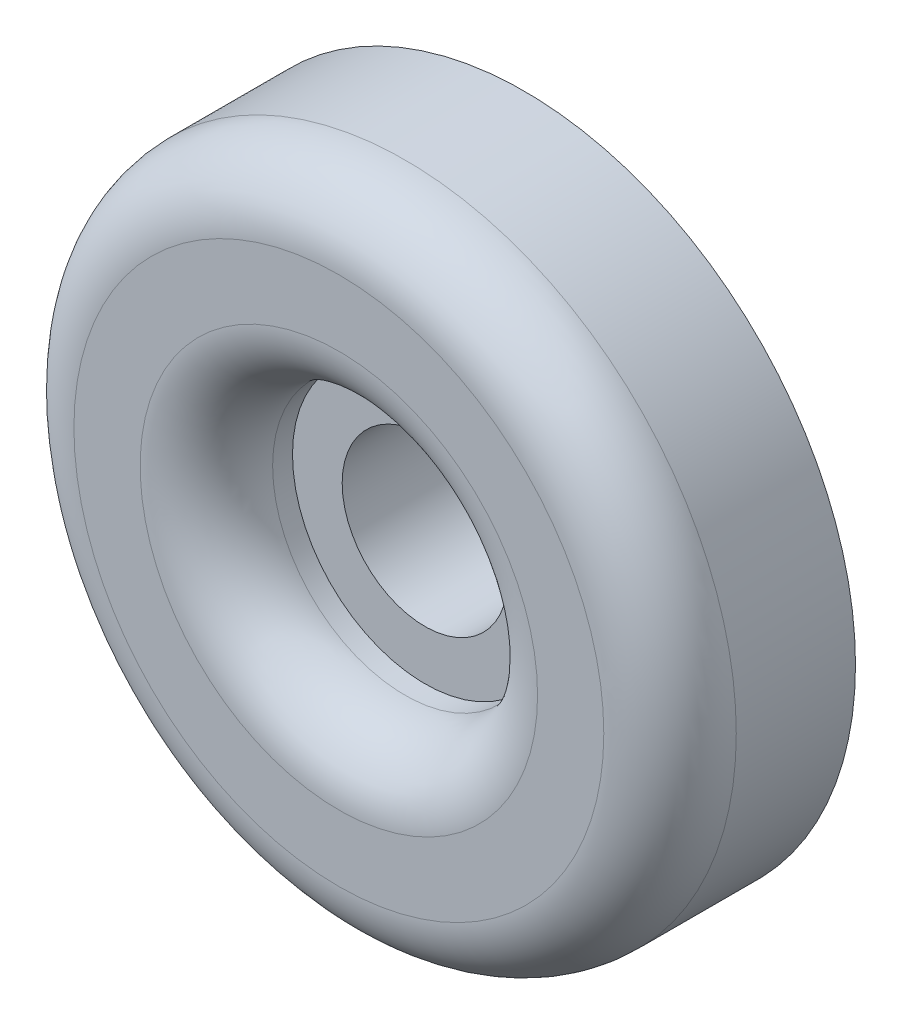
ISO-10303-21;
HEADER;
FILE_DESCRIPTION(('STEP AP214'),'2;1');
FILE_NAME('part.step','',(''),(''),'','','');
FILE_SCHEMA(('AUTOMOTIVE_DESIGN { 1 0 10303 214 1 1 1 1 }'));
ENDSEC;
DATA;
#1=APPLICATION_CONTEXT('core data for automotive mechanical design processes');
#2=APPLICATION_PROTOCOL_DEFINITION('international standard','automotive_design',2000,#1);
#3=PRODUCT_CONTEXT('',#1,'mechanical');
#4=PRODUCT('Part','Part','',(#3));
#5=PRODUCT_RELATED_PRODUCT_CATEGORY('part','',(#4));
#6=PRODUCT_DEFINITION_FORMATION('','',#4);
#7=PRODUCT_DEFINITION_CONTEXT('part definition',#1,'design');
#8=PRODUCT_DEFINITION('design','',#6,#7);
#9=PRODUCT_DEFINITION_SHAPE('','',#8);
#10=(LENGTH_UNIT() NAMED_UNIT(*) SI_UNIT(.MILLI.,.METRE.));
#11=(NAMED_UNIT(*) PLANE_ANGLE_UNIT() SI_UNIT($,.RADIAN.));
#12=(NAMED_UNIT(*) SI_UNIT($,.STERADIAN.) SOLID_ANGLE_UNIT());
#13=UNCERTAINTY_MEASURE_WITH_UNIT(LENGTH_MEASURE(1.E-05),#10,'distance_accuracy_value','');
#14=(GEOMETRIC_REPRESENTATION_CONTEXT(3) GLOBAL_UNCERTAINTY_ASSIGNED_CONTEXT((#13)) GLOBAL_UNIT_ASSIGNED_CONTEXT((#10,
#11,#12)) REPRESENTATION_CONTEXT('',''));
#15=CARTESIAN_POINT('',(0.,0.,0.));
#16=DIRECTION('',(0.,0.,1.));
#17=DIRECTION('',(1.,0.,0.));
#18=AXIS2_PLACEMENT_3D('',#15,#16,#17);
#19=CARTESIAN_POINT('',(0.,0.,3.81));
#20=DIRECTION('',(0.,0.,1.));
#21=DIRECTION('',(1.,0.,0.));
#22=AXIS2_PLACEMENT_3D('',#19,#20,#21);
#23=PLANE('',#22);
#24=CARTESIAN_POINT('',(0.,0.,3.81));
#25=DIRECTION('',(0.,0.,1.));
#26=DIRECTION('',(1.,0.,0.));
#27=AXIS2_PLACEMENT_3D('',#24,#25,#26);
#28=CIRCLE('',#27,3.175);
#29=CARTESIAN_POINT('',(-3.175,0.,3.81));
#30=VERTEX_POINT('',#29);
#31=EDGE_CURVE('E60',#30,#30,#28,.T.);
#32=ORIENTED_EDGE('',*,*,#31,.F.);
#33=EDGE_LOOP('',(#32));
#34=FACE_BOUND('',#33,.T.);
#35=CARTESIAN_POINT('',(0.,0.,3.81));
#36=DIRECTION('',(0.,0.,1.));
#37=DIRECTION('',(1.,0.,0.));
#38=AXIS2_PLACEMENT_3D('',#35,#36,#37);
#39=CIRCLE('',#38,5.08);
#40=CARTESIAN_POINT('',(-5.08,0.,3.81));
#41=VERTEX_POINT('',#40);
#42=EDGE_CURVE('E64',#41,#41,#39,.T.);
#43=ORIENTED_EDGE('',*,*,#42,.T.);
#44=EDGE_LOOP('',(#43));
#45=FACE_BOUND('',#44,.T.);
#46=ADVANCED_FACE('F37',(#34,#45),#23,.T.);
#47=CARTESIAN_POINT('',(0.,0.,0.));
#48=DIRECTION('',(0.,0.,1.));
#49=DIRECTION('',(1.,0.,0.));
#50=AXIS2_PLACEMENT_3D('',#47,#48,#49);
#51=PLANE('',#50);
#52=CARTESIAN_POINT('',(0.,0.,0.));
#53=DIRECTION('',(0.,0.,1.));
#54=DIRECTION('',(1.,0.,0.));
#55=AXIS2_PLACEMENT_3D('',#52,#53,#54);
#56=CIRCLE('',#55,12.7);
#57=CARTESIAN_POINT('',(-12.7,0.,0.));
#58=VERTEX_POINT('',#57);
#59=EDGE_CURVE('E57',#58,#58,#56,.T.);
#60=ORIENTED_EDGE('',*,*,#59,.F.);
#61=EDGE_LOOP('',(#60));
#62=FACE_BOUND('',#61,.T.);
#63=CARTESIAN_POINT('',(0.,0.,0.));
#64=DIRECTION('',(0.,0.,1.));
#65=DIRECTION('',(1.,0.,0.));
#66=AXIS2_PLACEMENT_3D('',#63,#64,#65);
#67=CIRCLE('',#66,3.175);
#68=CARTESIAN_POINT('',(-3.175,0.,0.));
#69=VERTEX_POINT('',#68);
#70=EDGE_CURVE('E61',#69,#69,#67,.T.);
#71=ORIENTED_EDGE('',*,*,#70,.T.);
#72=EDGE_LOOP('',(#71));
#73=FACE_BOUND('',#72,.T.);
#74=ADVANCED_FACE('F85',(#62,#73),#51,.F.);
#75=CARTESIAN_POINT('',(0.,0.,3.81));
#76=DIRECTION('',(0.,0.,-1.));
#77=DIRECTION('',(-1.,0.,0.));
#78=AXIS2_PLACEMENT_3D('',#75,#76,#77);
#79=CYLINDRICAL_SURFACE('',#78,12.7);
#80=CARTESIAN_POINT('',(0.,0.,4.572));
#81=DIRECTION('',(0.,0.,1.));
#82=DIRECTION('',(1.,0.,0.));
#83=AXIS2_PLACEMENT_3D('',#80,#81,#82);
#84=CIRCLE('',#83,12.7);
#85=CARTESIAN_POINT('',(-12.7,0.,4.572));
#86=VERTEX_POINT('',#85);
#87=EDGE_CURVE('E10',#86,#86,#84,.F.);
#88=CARTESIAN_POINT('',(-12.7,0.,4.572));
#89=CARTESIAN_POINT('',(-12.7,0.,4.524375));
#90=CARTESIAN_POINT('',(-12.7,0.,4.47675));
#91=CARTESIAN_POINT('',(-12.7,0.,4.3815));
#92=CARTESIAN_POINT('',(-12.7,0.,4.333875));
#93=CARTESIAN_POINT('',(-12.7,0.,4.238625));
#94=CARTESIAN_POINT('',(-12.7,0.,4.191));
#95=CARTESIAN_POINT('',(-12.7,0.,4.09575));
#96=CARTESIAN_POINT('',(-12.7,0.,4.048125));
#97=CARTESIAN_POINT('',(-12.7,0.,3.952875));
#98=CARTESIAN_POINT('',(-12.7,0.,3.90525));
#99=CARTESIAN_POINT('',(-12.7,0.,3.81));
#100=CARTESIAN_POINT('',(-12.7,0.,3.762375));
#101=CARTESIAN_POINT('',(-12.7,0.,3.667125));
#102=CARTESIAN_POINT('',(-12.7,0.,3.6195));
#103=CARTESIAN_POINT('',(-12.7,0.,3.52425));
#104=CARTESIAN_POINT('',(-12.7,0.,3.476625));
#105=CARTESIAN_POINT('',(-12.7,0.,3.381375));
#106=CARTESIAN_POINT('',(-12.7,0.,3.33375));
#107=CARTESIAN_POINT('',(-12.7,0.,3.2385));
#108=CARTESIAN_POINT('',(-12.7,0.,3.190875));
#109=CARTESIAN_POINT('',(-12.7,0.,3.095625));
#110=CARTESIAN_POINT('',(-12.7,0.,3.048));
#111=CARTESIAN_POINT('',(-12.7,0.,2.95275));
#112=CARTESIAN_POINT('',(-12.7,0.,2.905125));
#113=CARTESIAN_POINT('',(-12.7,0.,2.809875));
#114=CARTESIAN_POINT('',(-12.7,0.,2.76225));
#115=CARTESIAN_POINT('',(-12.7,0.,2.667));
#116=CARTESIAN_POINT('',(-12.7,0.,2.619375));
#117=CARTESIAN_POINT('',(-12.7,0.,2.524125));
#118=CARTESIAN_POINT('',(-12.7,0.,2.4765));
#119=CARTESIAN_POINT('',(-12.7,0.,2.38125));
#120=CARTESIAN_POINT('',(-12.7,0.,2.333625));
#121=CARTESIAN_POINT('',(-12.7,0.,2.238375));
#122=CARTESIAN_POINT('',(-12.7,0.,2.19075));
#123=CARTESIAN_POINT('',(-12.7,0.,2.0955));
#124=CARTESIAN_POINT('',(-12.7,0.,2.047875));
#125=CARTESIAN_POINT('',(-12.7,0.,1.952625));
#126=CARTESIAN_POINT('',(-12.7,0.,1.905));
#127=CARTESIAN_POINT('',(-12.7,0.,1.80975));
#128=CARTESIAN_POINT('',(-12.7,0.,1.762125));
#129=CARTESIAN_POINT('',(-12.7,0.,1.666875));
#130=CARTESIAN_POINT('',(-12.7,0.,1.61925));
#131=CARTESIAN_POINT('',(-12.7,0.,1.524));
#132=CARTESIAN_POINT('',(-12.7,0.,1.476375));
#133=CARTESIAN_POINT('',(-12.7,0.,1.381125));
#134=CARTESIAN_POINT('',(-12.7,0.,1.3335));
#135=CARTESIAN_POINT('',(-12.7,0.,1.23825));
#136=CARTESIAN_POINT('',(-12.7,0.,1.190625));
#137=CARTESIAN_POINT('',(-12.7,0.,1.095375));
#138=CARTESIAN_POINT('',(-12.7,0.,1.04775));
#139=CARTESIAN_POINT('',(-12.7,0.,0.9525));
#140=CARTESIAN_POINT('',(-12.7,0.,0.904875));
#141=CARTESIAN_POINT('',(-12.7,0.,0.809625));
#142=CARTESIAN_POINT('',(-12.7,0.,0.762));
#143=CARTESIAN_POINT('',(-12.7,0.,0.66675));
#144=CARTESIAN_POINT('',(-12.7,0.,0.619125));
#145=CARTESIAN_POINT('',(-12.7,0.,0.523875));
#146=CARTESIAN_POINT('',(-12.7,0.,0.47625));
#147=CARTESIAN_POINT('',(-12.7,0.,0.381));
#148=CARTESIAN_POINT('',(-12.7,0.,0.333375));
#149=CARTESIAN_POINT('',(-12.7,0.,0.238125));
#150=CARTESIAN_POINT('',(-12.7,0.,0.1905));
#151=CARTESIAN_POINT('',(-12.7,0.,0.0952499999999998));
#152=CARTESIAN_POINT('',(-12.7,0.,0.0476249999999999));
#153=CARTESIAN_POINT('',(-12.7,0.,0.));
#154=B_SPLINE_CURVE_WITH_KNOTS('',3,(#88,#89,#90,#91,#92,#93,#94,#95,#96,#97,#98,#99,#100,#101,
#102,#103,#104,#105,#106,#107,#108,#109,#110,#111,#112,#113,#114,#115,#116,#117,#118,#119,#120,
#121,#122,#123,#124,#125,#126,#127,#128,#129,#130,#131,#132,#133,#134,#135,#136,#137,#138,#139,
#140,#141,#142,#143,#144,#145,#146,#147,#148,#149,#150,#151,#152,#153),.UNSPECIFIED.,.F.,.F.,(4,
2,2,2,2,2,2,2,2,2,2,2,2,2,2,2,2,2,2,2,2,2,2,2,2,2,2,2,2,2,2,2,4),(0.,0.142875,0.28575,
0.428624999999999,0.5715,0.714375,0.85725,1.000125,1.143,1.285875,1.42875,1.571625,1.7145,
1.857375,2.00025,2.143125,2.286,2.428875,2.57175,2.714625,2.8575,3.000375,3.14325,3.286125,
3.429,3.571875,3.71475,3.857625,4.0005,4.143375,4.28625,4.429125,4.572),.UNSPECIFIED.);
#155=EDGE_CURVE('BSEAM93',#86,#58,#154,.T.);
#156=ORIENTED_EDGE('',*,*,#87,.T.);
#157=ORIENTED_EDGE('',*,*,#59,.T.);
#158=ORIENTED_EDGE('',*,*,#155,.T.);
#159=ORIENTED_EDGE('',*,*,#155,.F.);
#160=EDGE_LOOP('',(#156,#158,#157,#159));
#161=FACE_BOUND('',#160,.T.);
#162=ADVANCED_FACE('F93',(#161),#79,.T.);
#163=CARTESIAN_POINT('',(0.,0.,3.81));
#164=DIRECTION('',(0.,0.,-1.));
#165=DIRECTION('',(-1.,0.,0.));
#166=AXIS2_PLACEMENT_3D('',#163,#164,#165);
#167=CYLINDRICAL_SURFACE('',#166,3.175);
#168=CARTESIAN_POINT('',(-3.175,0.,3.81));
#169=CARTESIAN_POINT('',(-3.175,0.,3.7703125));
#170=CARTESIAN_POINT('',(-3.175,0.,3.730625));
#171=CARTESIAN_POINT('',(-3.175,0.,3.65125));
#172=CARTESIAN_POINT('',(-3.175,0.,3.6115625));
#173=CARTESIAN_POINT('',(-3.175,0.,3.5321875));
#174=CARTESIAN_POINT('',(-3.175,0.,3.4925));
#175=CARTESIAN_POINT('',(-3.175,0.,3.413125));
#176=CARTESIAN_POINT('',(-3.175,0.,3.3734375));
#177=CARTESIAN_POINT('',(-3.175,0.,3.2940625));
#178=CARTESIAN_POINT('',(-3.175,0.,3.254375));
#179=CARTESIAN_POINT('',(-3.175,0.,3.175));
#180=CARTESIAN_POINT('',(-3.175,0.,3.1353125));
#181=CARTESIAN_POINT('',(-3.175,0.,3.0559375));
#182=CARTESIAN_POINT('',(-3.175,0.,3.01625));
#183=CARTESIAN_POINT('',(-3.175,0.,2.936875));
#184=CARTESIAN_POINT('',(-3.175,0.,2.8971875));
#185=CARTESIAN_POINT('',(-3.175,0.,2.8178125));
#186=CARTESIAN_POINT('',(-3.175,0.,2.778125));
#187=CARTESIAN_POINT('',(-3.175,0.,2.69875));
#188=CARTESIAN_POINT('',(-3.175,0.,2.6590625));
#189=CARTESIAN_POINT('',(-3.175,0.,2.5796875));
#190=CARTESIAN_POINT('',(-3.175,0.,2.54));
#191=CARTESIAN_POINT('',(-3.175,0.,2.460625));
#192=CARTESIAN_POINT('',(-3.175,0.,2.4209375));
#193=CARTESIAN_POINT('',(-3.175,0.,2.3415625));
#194=CARTESIAN_POINT('',(-3.175,0.,2.301875));
#195=CARTESIAN_POINT('',(-3.175,0.,2.2225));
#196=CARTESIAN_POINT('',(-3.175,0.,2.1828125));
#197=CARTESIAN_POINT('',(-3.175,0.,2.1034375));
#198=CARTESIAN_POINT('',(-3.175,0.,2.06375));
#199=CARTESIAN_POINT('',(-3.175,0.,1.984375));
#200=CARTESIAN_POINT('',(-3.175,0.,1.9446875));
#201=CARTESIAN_POINT('',(-3.175,0.,1.8653125));
#202=CARTESIAN_POINT('',(-3.175,0.,1.825625));
#203=CARTESIAN_POINT('',(-3.175,0.,1.74625));
#204=CARTESIAN_POINT('',(-3.175,0.,1.7065625));
#205=CARTESIAN_POINT('',(-3.175,0.,1.6271875));
#206=CARTESIAN_POINT('',(-3.175,0.,1.5875));
#207=CARTESIAN_POINT('',(-3.175,0.,1.508125));
#208=CARTESIAN_POINT('',(-3.175,0.,1.4684375));
#209=CARTESIAN_POINT('',(-3.175,0.,1.3890625));
#210=CARTESIAN_POINT('',(-3.175,0.,1.349375));
#211=CARTESIAN_POINT('',(-3.175,0.,1.27));
#212=CARTESIAN_POINT('',(-3.175,0.,1.2303125));
#213=CARTESIAN_POINT('',(-3.175,0.,1.1509375));
#214=CARTESIAN_POINT('',(-3.175,0.,1.11125));
#215=CARTESIAN_POINT('',(-3.175,0.,1.031875));
#216=CARTESIAN_POINT('',(-3.175,0.,0.9921875));
#217=CARTESIAN_POINT('',(-3.175,0.,0.9128125));
#218=CARTESIAN_POINT('',(-3.175,0.,0.873125));
#219=CARTESIAN_POINT('',(-3.175,0.,0.79375));
#220=CARTESIAN_POINT('',(-3.175,0.,0.7540625));
#221=CARTESIAN_POINT('',(-3.175,0.,0.6746875));
#222=CARTESIAN_POINT('',(-3.175,0.,0.635));
#223=CARTESIAN_POINT('',(-3.175,0.,0.555625));
#224=CARTESIAN_POINT('',(-3.175,0.,0.5159375));
#225=CARTESIAN_POINT('',(-3.175,0.,0.4365625));
#226=CARTESIAN_POINT('',(-3.175,0.,0.396875));
#227=CARTESIAN_POINT('',(-3.175,0.,0.3175));
#228=CARTESIAN_POINT('',(-3.175,0.,0.2778125));
#229=CARTESIAN_POINT('',(-3.175,0.,0.1984375));
#230=CARTESIAN_POINT('',(-3.175,0.,0.15875));
#231=CARTESIAN_POINT('',(-3.175,0.,0.0793749999999999));
#232=CARTESIAN_POINT('',(-3.175,0.,0.0396874999999999));
#233=CARTESIAN_POINT('',(-3.175,0.,0.));
#234=B_SPLINE_CURVE_WITH_KNOTS('',3,(#168,#169,#170,#171,#172,#173,#174,#175,#176,#177,#178,
#179,#180,#181,#182,#183,#184,#185,#186,#187,#188,#189,#190,#191,#192,#193,#194,#195,#196,#197,
#198,#199,#200,#201,#202,#203,#204,#205,#206,#207,#208,#209,#210,#211,#212,#213,#214,#215,#216,
#217,#218,#219,#220,#221,#222,#223,#224,#225,#226,#227,#228,#229,#230,#231,#232,#233),
.UNSPECIFIED.,.F.,.F.,(4,2,2,2,2,2,2,2,2,2,2,2,2,2,2,2,2,2,2,2,2,2,2,2,2,2,2,2,2,2,2,2,4),(0.,
0.1190625,0.238125,0.3571875,0.47625,0.595312499999999,0.714375,0.833437499999999,
0.952499999999999,1.0715625,1.190625,1.3096875,1.42875,1.5478125,1.666875,1.7859375,1.905,
2.0240625,2.143125,2.2621875,2.38125,2.5003125,2.619375,2.7384375,2.8575,2.9765625,3.095625,
3.2146875,3.33375,3.4528125,3.571875,3.6909375,3.81),.UNSPECIFIED.);
#235=EDGE_CURVE('BSEAM82',#30,#69,#234,.T.);
#236=ORIENTED_EDGE('',*,*,#31,.T.);
#237=ORIENTED_EDGE('',*,*,#70,.F.);
#238=ORIENTED_EDGE('',*,*,#235,.T.);
#239=ORIENTED_EDGE('',*,*,#235,.F.);
#240=EDGE_LOOP('',(#236,#238,#237,#239));
#241=FACE_BOUND('',#240,.T.);
#242=ADVANCED_FACE('F82',(#241),#167,.F.);
#243=CARTESIAN_POINT('',(0.,0.,7.112));
#244=DIRECTION('',(0.,0.,1.));
#245=DIRECTION('',(1.,0.,0.));
#246=AXIS2_PLACEMENT_3D('',#243,#244,#245);
#247=PLANE('',#246);
#248=CARTESIAN_POINT('',(0.,0.,7.112));
#249=DIRECTION('',(0.,0.,1.));
#250=DIRECTION('',(1.,0.,0.));
#251=AXIS2_PLACEMENT_3D('',#248,#249,#250);
#252=CIRCLE('',#251,7.62);
#253=CARTESIAN_POINT('',(7.62,0.,7.112));
#254=VERTEX_POINT('',#253);
#255=EDGE_CURVE('E44',#254,#254,#252,.F.);
#256=ORIENTED_EDGE('',*,*,#255,.T.);
#257=EDGE_LOOP('',(#256));
#258=FACE_BOUND('',#257,.T.);
#259=CARTESIAN_POINT('',(0.,0.,7.112));
#260=DIRECTION('',(0.,0.,1.));
#261=DIRECTION('',(1.,0.,0.));
#262=AXIS2_PLACEMENT_3D('',#259,#260,#261);
#263=CIRCLE('',#262,10.16);
#264=CARTESIAN_POINT('',(10.16,0.,7.112));
#265=VERTEX_POINT('',#264);
#266=EDGE_CURVE('E48',#265,#265,#263,.T.);
#267=ORIENTED_EDGE('',*,*,#266,.T.);
#268=EDGE_LOOP('',(#267));
#269=FACE_BOUND('',#268,.T.);
#270=ADVANCED_FACE('F74',(#258,#269),#247,.T.);
#271=CARTESIAN_POINT('',(0.,0.,7.112));
#272=DIRECTION('',(0.,0.,-1.));
#273=DIRECTION('',(-1.,0.,0.));
#274=AXIS2_PLACEMENT_3D('',#271,#272,#273);
#275=CYLINDRICAL_SURFACE('',#274,5.08);
#276=CARTESIAN_POINT('',(0.,0.,4.572));
#277=DIRECTION('',(0.,0.,1.));
#278=DIRECTION('',(1.,0.,0.));
#279=AXIS2_PLACEMENT_3D('',#276,#277,#278);
#280=CIRCLE('',#279,5.08);
#281=CARTESIAN_POINT('',(-5.08,0.,4.572));
#282=VERTEX_POINT('',#281);
#283=EDGE_CURVE('E52',#282,#282,#280,.T.);
#284=CARTESIAN_POINT('',(-5.08,0.,4.572));
#285=CARTESIAN_POINT('',(-5.08,0.,4.5640625));
#286=CARTESIAN_POINT('',(-5.08,0.,4.556125));
#287=CARTESIAN_POINT('',(-5.08,0.,4.54025));
#288=CARTESIAN_POINT('',(-5.08,0.,4.5323125));
#289=CARTESIAN_POINT('',(-5.08,0.,4.5164375));
#290=CARTESIAN_POINT('',(-5.08,0.,4.5085));
#291=CARTESIAN_POINT('',(-5.08,0.,4.492625));
#292=CARTESIAN_POINT('',(-5.08,0.,4.4846875));
#293=CARTESIAN_POINT('',(-5.08,0.,4.4688125));
#294=CARTESIAN_POINT('',(-5.08,0.,4.460875));
#295=CARTESIAN_POINT('',(-5.08,0.,4.445));
#296=CARTESIAN_POINT('',(-5.08,0.,4.4370625));
#297=CARTESIAN_POINT('',(-5.08,0.,4.4211875));
#298=CARTESIAN_POINT('',(-5.08,0.,4.41325));
#299=CARTESIAN_POINT('',(-5.08,0.,4.397375));
#300=CARTESIAN_POINT('',(-5.08,0.,4.3894375));
#301=CARTESIAN_POINT('',(-5.08,0.,4.3735625));
#302=CARTESIAN_POINT('',(-5.08,0.,4.365625));
#303=CARTESIAN_POINT('',(-5.08,0.,4.34975));
#304=CARTESIAN_POINT('',(-5.08,0.,4.3418125));
#305=CARTESIAN_POINT('',(-5.08,0.,4.3259375));
#306=CARTESIAN_POINT('',(-5.08,0.,4.318));
#307=CARTESIAN_POINT('',(-5.08,0.,4.302125));
#308=CARTESIAN_POINT('',(-5.08,0.,4.2941875));
#309=CARTESIAN_POINT('',(-5.08,0.,4.2783125));
#310=CARTESIAN_POINT('',(-5.08,0.,4.270375));
#311=CARTESIAN_POINT('',(-5.08,0.,4.2545));
#312=CARTESIAN_POINT('',(-5.08,0.,4.2465625));
#313=CARTESIAN_POINT('',(-5.08,0.,4.2306875));
#314=CARTESIAN_POINT('',(-5.08,0.,4.22275));
#315=CARTESIAN_POINT('',(-5.08,0.,4.206875));
#316=CARTESIAN_POINT('',(-5.08,0.,4.1989375));
#317=CARTESIAN_POINT('',(-5.08,0.,4.1830625));
#318=CARTESIAN_POINT('',(-5.08,0.,4.175125));
#319=CARTESIAN_POINT('',(-5.08,0.,4.15925));
#320=CARTESIAN_POINT('',(-5.08,0.,4.1513125));
#321=CARTESIAN_POINT('',(-5.08,0.,4.1354375));
#322=CARTESIAN_POINT('',(-5.08,0.,4.1275));
#323=CARTESIAN_POINT('',(-5.08,0.,4.111625));
#324=CARTESIAN_POINT('',(-5.08,0.,4.1036875));
#325=CARTESIAN_POINT('',(-5.08,0.,4.0878125));
#326=CARTESIAN_POINT('',(-5.08,0.,4.079875));
#327=CARTESIAN_POINT('',(-5.08,0.,4.064));
#328=CARTESIAN_POINT('',(-5.08,0.,4.0560625));
#329=CARTESIAN_POINT('',(-5.08,0.,4.0401875));
#330=CARTESIAN_POINT('',(-5.08,0.,4.03225));
#331=CARTESIAN_POINT('',(-5.08,0.,4.016375));
#332=CARTESIAN_POINT('',(-5.08,0.,4.0084375));
#333=CARTESIAN_POINT('',(-5.08,0.,3.9925625));
#334=CARTESIAN_POINT('',(-5.08,0.,3.984625));
#335=CARTESIAN_POINT('',(-5.08,0.,3.96875));
#336=CARTESIAN_POINT('',(-5.08,0.,3.9608125));
#337=CARTESIAN_POINT('',(-5.08,0.,3.9449375));
#338=CARTESIAN_POINT('',(-5.08,0.,3.937));
#339=CARTESIAN_POINT('',(-5.08,0.,3.921125));
#340=CARTESIAN_POINT('',(-5.08,0.,3.9131875));
#341=CARTESIAN_POINT('',(-5.08,0.,3.8973125));
#342=CARTESIAN_POINT('',(-5.08,0.,3.889375));
#343=CARTESIAN_POINT('',(-5.08,0.,3.8735));
#344=CARTESIAN_POINT('',(-5.08,0.,3.8655625));
#345=CARTESIAN_POINT('',(-5.08,0.,3.8496875));
#346=CARTESIAN_POINT('',(-5.08,0.,3.84175));
#347=CARTESIAN_POINT('',(-5.08,0.,3.825875));
#348=CARTESIAN_POINT('',(-5.08,0.,3.8179375));
#349=CARTESIAN_POINT('',(-5.08,0.,3.81));
#350=B_SPLINE_CURVE_WITH_KNOTS('',3,(#284,#285,#286,#287,#288,#289,#290,#291,#292,#293,#294,
#295,#296,#297,#298,#299,#300,#301,#302,#303,#304,#305,#306,#307,#308,#309,#310,#311,#312,#313,
#314,#315,#316,#317,#318,#319,#320,#321,#322,#323,#324,#325,#326,#327,#328,#329,#330,#331,#332,
#333,#334,#335,#336,#337,#338,#339,#340,#341,#342,#343,#344,#345,#346,#347,#348,#349),
.UNSPECIFIED.,.F.,.F.,(4,2,2,2,2,2,2,2,2,2,2,2,2,2,2,2,2,2,2,2,2,2,2,2,2,2,2,2,2,2,2,2,4),(0.,
0.0238125000000004,0.0476250000000008,0.0714375000000003,0.0952499999999998,0.1190625,
0.142875000000001,0.1666875,0.1905,0.214312500000001,0.238125,0.2619375,0.28575,
0.309562500000001,0.333375,0.3571875,0.381,0.404812500000001,0.428625,0.4524375,0.47625,
0.500062500000001,0.523875,0.5476875,0.571500000000001,0.5953125,0.619125,0.6429375,0.66675,
0.6905625,0.714375,0.7381875,0.762),.UNSPECIFIED.);
#351=EDGE_CURVE('BSEAM71',#282,#41,#350,.T.);
#352=ORIENTED_EDGE('',*,*,#283,.T.);
#353=ORIENTED_EDGE('',*,*,#42,.F.);
#354=ORIENTED_EDGE('',*,*,#351,.T.);
#355=ORIENTED_EDGE('',*,*,#351,.F.);
#356=EDGE_LOOP('',(#352,#354,#353,#355));
#357=FACE_BOUND('',#356,.T.);
#358=ADVANCED_FACE('F71',(#357),#275,.F.);
#359=CARTESIAN_POINT('',(0.,0.,4.572));
#360=DIRECTION('',(0.,0.,1.));
#361=DIRECTION('',(1.,0.,0.));
#362=AXIS2_PLACEMENT_3D('',#359,#360,#361);
#363=TOROIDAL_SURFACE('',#362,7.62,2.54);
#364=ORIENTED_EDGE('',*,*,#255,.F.);
#365=EDGE_LOOP('',(#364));
#366=FACE_BOUND('',#365,.T.);
#367=ORIENTED_EDGE('',*,*,#283,.F.);
#368=EDGE_LOOP('',(#367));
#369=FACE_BOUND('',#368,.T.);
#370=ADVANCED_FACE('F73',(#366,#369),#363,.T.);
#371=CARTESIAN_POINT('',(0.,0.,4.572));
#372=DIRECTION('',(0.,0.,1.));
#373=DIRECTION('',(1.,0.,0.));
#374=AXIS2_PLACEMENT_3D('',#371,#372,#373);
#375=TOROIDAL_SURFACE('',#374,10.16,2.54);
#376=ORIENTED_EDGE('',*,*,#87,.F.);
#377=EDGE_LOOP('',(#376));
#378=FACE_BOUND('',#377,.T.);
#379=ORIENTED_EDGE('',*,*,#266,.F.);
#380=EDGE_LOOP('',(#379));
#381=FACE_BOUND('',#380,.T.);
#382=ADVANCED_FACE('F39',(#378,#381),#375,.T.);
#383=CLOSED_SHELL('',(#46,#74,#162,#242,#270,#358,#370,#382));
#384=MANIFOLD_SOLID_BREP('B2',#383);
#385=ADVANCED_BREP_SHAPE_REPRESENTATION('',(#18,#384),#14);
#386=SHAPE_DEFINITION_REPRESENTATION(#9,#385);
ENDSEC;
END-ISO-10303-21;
